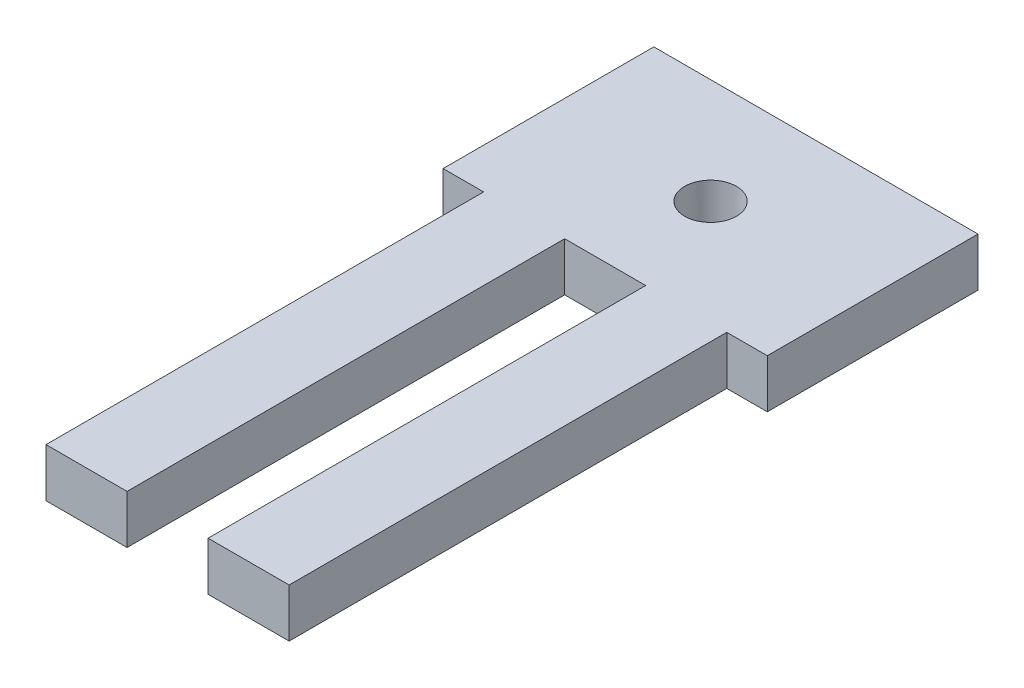
ISO-10303-21;
HEADER;
FILE_DESCRIPTION(('STEP AP214'),'2;1');
FILE_NAME('part.step','',(''),(''),'','','');
FILE_SCHEMA(('AUTOMOTIVE_DESIGN { 1 0 10303 214 1 1 1 1 }'));
ENDSEC;
DATA;
#1=APPLICATION_CONTEXT('core data for automotive mechanical design processes');
#2=APPLICATION_PROTOCOL_DEFINITION('international standard','automotive_design',2000,#1);
#3=PRODUCT_CONTEXT('',#1,'mechanical');
#4=PRODUCT('Part','Part','',(#3));
#5=PRODUCT_RELATED_PRODUCT_CATEGORY('part','',(#4));
#6=PRODUCT_DEFINITION_FORMATION('','',#4);
#7=PRODUCT_DEFINITION_CONTEXT('part definition',#1,'design');
#8=PRODUCT_DEFINITION('design','',#6,#7);
#9=PRODUCT_DEFINITION_SHAPE('','',#8);
#10=(LENGTH_UNIT() NAMED_UNIT(*) SI_UNIT(.MILLI.,.METRE.));
#11=(NAMED_UNIT(*) PLANE_ANGLE_UNIT() SI_UNIT($,.RADIAN.));
#12=(NAMED_UNIT(*) SI_UNIT($,.STERADIAN.) SOLID_ANGLE_UNIT());
#13=UNCERTAINTY_MEASURE_WITH_UNIT(LENGTH_MEASURE(1.E-05),#10,'distance_accuracy_value','');
#14=(GEOMETRIC_REPRESENTATION_CONTEXT(3) GLOBAL_UNCERTAINTY_ASSIGNED_CONTEXT((#13)) GLOBAL_UNIT_ASSIGNED_CONTEXT((#10,
#11,#12)) REPRESENTATION_CONTEXT('',''));
#15=CARTESIAN_POINT('',(0.,0.,0.));
#16=DIRECTION('',(0.,0.,1.));
#17=DIRECTION('',(1.,0.,0.));
#18=AXIS2_PLACEMENT_3D('',#15,#16,#17);
#19=CARTESIAN_POINT('',(0.,3.,0.));
#20=DIRECTION('',(0.,0.,-1.));
#21=DIRECTION('',(-1.,0.,0.));
#22=AXIS2_PLACEMENT_3D('',#19,#20,#21);
#23=PLANE('',#22);
#24=DIRECTION('',(1.,0.,0.));
#25=VECTOR('',#24,1.);
#26=CARTESIAN_POINT('',(0.,3.,0.));
#27=LINE('',#26,#25);
#28=CARTESIAN_POINT('',(12.5,3.,0.));
#29=VERTEX_POINT('',#28);
#30=CARTESIAN_POINT('',(17.5,3.,0.));
#31=VERTEX_POINT('',#30);
#32=EDGE_CURVE('E203',#29,#31,#27,.T.);
#33=ORIENTED_EDGE('',*,*,#32,.F.);
#34=DIRECTION('',(0.,1.,0.));
#35=VECTOR('',#34,1.);
#36=CARTESIAN_POINT('',(12.5,0.,0.));
#37=LINE('',#36,#35);
#38=CARTESIAN_POINT('',(12.5,0.,0.));
#39=VERTEX_POINT('',#38);
#40=EDGE_CURVE('E147',#39,#29,#37,.T.);
#41=ORIENTED_EDGE('',*,*,#40,.F.);
#42=DIRECTION('',(1.,0.,0.));
#43=VECTOR('',#42,1.);
#44=CARTESIAN_POINT('',(0.,0.,0.));
#45=LINE('',#44,#43);
#46=CARTESIAN_POINT('',(17.5,0.,0.));
#47=VERTEX_POINT('',#46);
#48=EDGE_CURVE('E143',#39,#47,#45,.T.);
#49=ORIENTED_EDGE('',*,*,#48,.T.);
#50=DIRECTION('',(0.,1.,0.));
#51=VECTOR('',#50,1.);
#52=CARTESIAN_POINT('',(17.5,-0.00100000000000013,0.));
#53=LINE('',#52,#51);
#54=EDGE_CURVE('E173',#47,#31,#53,.T.);
#55=ORIENTED_EDGE('',*,*,#54,.T.);
#56=EDGE_LOOP('',(#33,#41,#49,#55));
#57=FACE_BOUND('',#56,.T.);
#58=ADVANCED_FACE('F33',(#57),#23,.F.);
#59=CARTESIAN_POINT('',(2.5,0.,0.));
#60=VERTEX_POINT('',#59);
#61=CARTESIAN_POINT('',(7.5,0.,0.));
#62=VERTEX_POINT('',#61);
#63=EDGE_CURVE('E214',#60,#62,#45,.T.);
#64=ORIENTED_EDGE('',*,*,#63,.T.);
#65=DIRECTION('',(0.,1.,0.));
#66=VECTOR('',#65,1.);
#67=CARTESIAN_POINT('',(7.5,0.,0.));
#68=LINE('',#67,#66);
#69=CARTESIAN_POINT('',(7.5,3.,0.));
#70=VERTEX_POINT('',#69);
#71=EDGE_CURVE('E150',#62,#70,#68,.T.);
#72=ORIENTED_EDGE('',*,*,#71,.T.);
#73=CARTESIAN_POINT('',(2.5,3.,0.));
#74=VERTEX_POINT('',#73);
#75=EDGE_CURVE('E205',#74,#70,#27,.T.);
#76=ORIENTED_EDGE('',*,*,#75,.F.);
#77=DIRECTION('',(0.,1.,0.));
#78=VECTOR('',#77,1.);
#79=CARTESIAN_POINT('',(2.5,-0.00100000000000013,0.));
#80=LINE('',#79,#78);
#81=EDGE_CURVE('E192',#60,#74,#80,.T.);
#82=ORIENTED_EDGE('',*,*,#81,.F.);
#83=EDGE_LOOP('',(#64,#72,#76,#82));
#84=FACE_BOUND('',#83,.T.);
#85=ADVANCED_FACE('F253',(#84),#23,.F.);
#86=CARTESIAN_POINT('',(20.,3.,0.));
#87=DIRECTION('',(-1.,0.,0.));
#88=DIRECTION('',(0.,0.,1.));
#89=AXIS2_PLACEMENT_3D('',#86,#87,#88);
#90=PLANE('',#89);
#91=DIRECTION('',(0.,1.,0.));
#92=VECTOR('',#91,1.);
#93=CARTESIAN_POINT('',(20.,-0.00100000000000013,-27.));
#94=LINE('',#93,#92);
#95=CARTESIAN_POINT('',(20.,0.,-27.));
#96=VERTEX_POINT('',#95);
#97=CARTESIAN_POINT('',(20.,3.,-27.));
#98=VERTEX_POINT('',#97);
#99=EDGE_CURVE('E172',#96,#98,#94,.T.);
#100=ORIENTED_EDGE('',*,*,#99,.F.);
#101=DIRECTION('',(0.,0.,-1.));
#102=VECTOR('',#101,1.);
#103=CARTESIAN_POINT('',(20.,0.,0.));
#104=LINE('',#103,#102);
#105=CARTESIAN_POINT('',(20.,0.,-40.));
#106=VERTEX_POINT('',#105);
#107=EDGE_CURVE('E217',#96,#106,#104,.T.);
#108=ORIENTED_EDGE('',*,*,#107,.T.);
#109=DIRECTION('',(0.,-1.,0.));
#110=VECTOR('',#109,1.);
#111=CARTESIAN_POINT('',(20.,3.,-40.));
#112=LINE('',#111,#110);
#113=CARTESIAN_POINT('',(20.,3.,-40.));
#114=VERTEX_POINT('',#113);
#115=EDGE_CURVE('E11',#114,#106,#112,.T.);
#116=ORIENTED_EDGE('',*,*,#115,.F.);
#117=DIRECTION('',(0.,0.,-1.));
#118=VECTOR('',#117,1.);
#119=CARTESIAN_POINT('',(20.,3.,0.));
#120=LINE('',#119,#118);
#121=EDGE_CURVE('E208',#98,#114,#120,.T.);
#122=ORIENTED_EDGE('',*,*,#121,.F.);
#123=EDGE_LOOP('',(#100,#108,#116,#122));
#124=FACE_BOUND('',#123,.T.);
#125=ADVANCED_FACE('F241',(#124),#90,.F.);
#126=CARTESIAN_POINT('',(0.,3.,0.));
#127=DIRECTION('',(0.,-1.,0.));
#128=DIRECTION('',(0.,0.,-1.));
#129=AXIS2_PLACEMENT_3D('',#126,#127,#128);
#130=PLANE('',#129);
#131=CARTESIAN_POINT('',(10.,3.,-33.5));
#132=DIRECTION('',(0.,-1.,0.));
#133=DIRECTION('',(0.,0.,-1.));
#134=AXIS2_PLACEMENT_3D('',#131,#132,#133);
#135=CIRCLE('',#134,1.6);
#136=CARTESIAN_POINT('',(10.,3.,-35.1));
#137=VERTEX_POINT('',#136);
#138=EDGE_CURVE('E162',#137,#137,#135,.T.);
#139=ORIENTED_EDGE('',*,*,#138,.T.);
#140=EDGE_LOOP('',(#139));
#141=FACE_BOUND('',#140,.T.);
#142=DIRECTION('',(1.,0.,0.));
#143=VECTOR('',#142,1.);
#144=CARTESIAN_POINT('',(0.,3.,-27.));
#145=LINE('',#144,#143);
#146=CARTESIAN_POINT('',(7.5,3.,-27.));
#147=VERTEX_POINT('',#146);
#148=CARTESIAN_POINT('',(12.5,3.,-27.));
#149=VERTEX_POINT('',#148);
#150=EDGE_CURVE('E149',#147,#149,#145,.T.);
#151=ORIENTED_EDGE('',*,*,#150,.T.);
#152=DIRECTION('',(0.,0.,1.));
#153=VECTOR('',#152,1.);
#154=CARTESIAN_POINT('',(12.5,3.,0.));
#155=LINE('',#154,#153);
#156=EDGE_CURVE('E130',#149,#29,#155,.T.);
#157=ORIENTED_EDGE('',*,*,#156,.T.);
#158=ORIENTED_EDGE('',*,*,#32,.T.);
#159=DIRECTION('',(0.,0.,-1.));
#160=VECTOR('',#159,1.);
#161=CARTESIAN_POINT('',(17.5,3.,-27.));
#162=LINE('',#161,#160);
#163=CARTESIAN_POINT('',(17.5,3.,-27.));
#164=VERTEX_POINT('',#163);
#165=EDGE_CURVE('E169',#31,#164,#162,.T.);
#166=ORIENTED_EDGE('',*,*,#165,.T.);
#167=DIRECTION('',(1.,0.,0.));
#168=VECTOR('',#167,1.);
#169=CARTESIAN_POINT('',(20.,3.,-27.));
#170=LINE('',#169,#168);
#171=EDGE_CURVE('E166',#164,#98,#170,.T.);
#172=ORIENTED_EDGE('',*,*,#171,.T.);
#173=ORIENTED_EDGE('',*,*,#121,.T.);
#174=DIRECTION('',(-1.,0.,0.));
#175=VECTOR('',#174,1.);
#176=CARTESIAN_POINT('',(0.,3.,-40.));
#177=LINE('',#176,#175);
#178=CARTESIAN_POINT('',(0.,3.,-40.));
#179=VERTEX_POINT('',#178);
#180=EDGE_CURVE('E210',#114,#179,#177,.T.);
#181=ORIENTED_EDGE('',*,*,#180,.T.);
#182=DIRECTION('',(0.,0.,1.));
#183=VECTOR('',#182,1.);
#184=CARTESIAN_POINT('',(0.,3.,0.));
#185=LINE('',#184,#183);
#186=CARTESIAN_POINT('',(0.,3.,-27.));
#187=VERTEX_POINT('',#186);
#188=EDGE_CURVE('E200',#179,#187,#185,.T.);
#189=ORIENTED_EDGE('',*,*,#188,.T.);
#190=DIRECTION('',(-1.,0.,0.));
#191=VECTOR('',#190,1.);
#192=CARTESIAN_POINT('',(0.,3.,-27.));
#193=LINE('',#192,#191);
#194=CARTESIAN_POINT('',(2.5,3.,-27.));
#195=VERTEX_POINT('',#194);
#196=EDGE_CURVE('E190',#195,#187,#193,.T.);
#197=ORIENTED_EDGE('',*,*,#196,.F.);
#198=DIRECTION('',(0.,0.,-1.));
#199=VECTOR('',#198,1.);
#200=CARTESIAN_POINT('',(2.5,3.,-27.));
#201=LINE('',#200,#199);
#202=EDGE_CURVE('E187',#74,#195,#201,.T.);
#203=ORIENTED_EDGE('',*,*,#202,.F.);
#204=ORIENTED_EDGE('',*,*,#75,.T.);
#205=DIRECTION('',(0.,0.,-1.));
#206=VECTOR('',#205,1.);
#207=CARTESIAN_POINT('',(7.5,3.,0.));
#208=LINE('',#207,#206);
#209=EDGE_CURVE('E155',#70,#147,#208,.T.);
#210=ORIENTED_EDGE('',*,*,#209,.T.);
#211=EDGE_LOOP('',(#151,#157,#158,#166,#172,#173,#181,#189,#197,#203,#204,#210));
#212=FACE_BOUND('',#211,.T.);
#213=ADVANCED_FACE('F234',(#141,#212),#130,.F.);
#214=CARTESIAN_POINT('',(0.,0.,0.));
#215=DIRECTION('',(0.,-1.,0.));
#216=DIRECTION('',(0.,0.,-1.));
#217=AXIS2_PLACEMENT_3D('',#214,#215,#216);
#218=PLANE('',#217);
#219=DIRECTION('',(0.,0.,-1.));
#220=VECTOR('',#219,1.);
#221=CARTESIAN_POINT('',(12.5,0.,0.));
#222=LINE('',#221,#220);
#223=CARTESIAN_POINT('',(12.5,0.,-27.));
#224=VERTEX_POINT('',#223);
#225=EDGE_CURVE('E127',#39,#224,#222,.T.);
#226=ORIENTED_EDGE('',*,*,#225,.T.);
#227=DIRECTION('',(-1.,0.,0.));
#228=VECTOR('',#227,1.);
#229=CARTESIAN_POINT('',(12.5,0.,-27.));
#230=LINE('',#229,#228);
#231=CARTESIAN_POINT('',(7.5,0.,-27.));
#232=VERTEX_POINT('',#231);
#233=EDGE_CURVE('E136',#224,#232,#230,.T.);
#234=ORIENTED_EDGE('',*,*,#233,.T.);
#235=DIRECTION('',(0.,0.,1.));
#236=VECTOR('',#235,1.);
#237=CARTESIAN_POINT('',(7.5,0.,0.));
#238=LINE('',#237,#236);
#239=EDGE_CURVE('E48',#232,#62,#238,.T.);
#240=ORIENTED_EDGE('',*,*,#239,.T.);
#241=ORIENTED_EDGE('',*,*,#63,.F.);
#242=DIRECTION('',(0.,0.,-1.));
#243=VECTOR('',#242,1.);
#244=CARTESIAN_POINT('',(2.5,0.,-27.));
#245=LINE('',#244,#243);
#246=CARTESIAN_POINT('',(2.5,0.,-27.));
#247=VERTEX_POINT('',#246);
#248=EDGE_CURVE('E181',#60,#247,#245,.T.);
#249=ORIENTED_EDGE('',*,*,#248,.T.);
#250=DIRECTION('',(-1.,0.,0.));
#251=VECTOR('',#250,1.);
#252=CARTESIAN_POINT('',(0.,0.,-27.));
#253=LINE('',#252,#251);
#254=CARTESIAN_POINT('',(0.,0.,-27.));
#255=VERTEX_POINT('',#254);
#256=EDGE_CURVE('E184',#247,#255,#253,.T.);
#257=ORIENTED_EDGE('',*,*,#256,.T.);
#258=DIRECTION('',(0.,0.,1.));
#259=VECTOR('',#258,1.);
#260=CARTESIAN_POINT('',(0.,0.,0.));
#261=LINE('',#260,#259);
#262=CARTESIAN_POINT('',(0.,0.,-40.));
#263=VERTEX_POINT('',#262);
#264=EDGE_CURVE('E196',#263,#255,#261,.T.);
#265=ORIENTED_EDGE('',*,*,#264,.F.);
#266=DIRECTION('',(-1.,0.,0.));
#267=VECTOR('',#266,1.);
#268=CARTESIAN_POINT('',(0.,0.,-40.));
#269=LINE('',#268,#267);
#270=EDGE_CURVE('E204',#106,#263,#269,.T.);
#271=ORIENTED_EDGE('',*,*,#270,.F.);
#272=ORIENTED_EDGE('',*,*,#107,.F.);
#273=DIRECTION('',(1.,0.,0.));
#274=VECTOR('',#273,1.);
#275=CARTESIAN_POINT('',(20.,0.,-27.));
#276=LINE('',#275,#274);
#277=CARTESIAN_POINT('',(17.5,0.,-27.));
#278=VERTEX_POINT('',#277);
#279=EDGE_CURVE('E176',#278,#96,#276,.T.);
#280=ORIENTED_EDGE('',*,*,#279,.F.);
#281=DIRECTION('',(0.,0.,-1.));
#282=VECTOR('',#281,1.);
#283=CARTESIAN_POINT('',(17.5,0.,-27.));
#284=LINE('',#283,#282);
#285=EDGE_CURVE('E56',#47,#278,#284,.T.);
#286=ORIENTED_EDGE('',*,*,#285,.F.);
#287=ORIENTED_EDGE('',*,*,#48,.F.);
#288=EDGE_LOOP('',(#226,#234,#240,#241,#249,#257,#265,#271,#272,#280,#286,#287));
#289=FACE_BOUND('',#288,.T.);
#290=CARTESIAN_POINT('',(10.,0.,-33.5));
#291=DIRECTION('',(0.,1.,0.));
#292=DIRECTION('',(0.,0.,1.));
#293=AXIS2_PLACEMENT_3D('',#290,#291,#292);
#294=CIRCLE('',#293,1.6);
#295=CARTESIAN_POINT('',(10.,0.,-31.9));
#296=VERTEX_POINT('',#295);
#297=EDGE_CURVE('E159',#296,#296,#294,.T.);
#298=ORIENTED_EDGE('',*,*,#297,.T.);
#299=EDGE_LOOP('',(#298));
#300=FACE_BOUND('',#299,.T.);
#301=ADVANCED_FACE('F141',(#289,#300),#218,.T.);
#302=CARTESIAN_POINT('',(0.,3.,0.));
#303=DIRECTION('',(1.,0.,0.));
#304=DIRECTION('',(0.,0.,-1.));
#305=AXIS2_PLACEMENT_3D('',#302,#303,#304);
#306=PLANE('',#305);
#307=ORIENTED_EDGE('',*,*,#264,.T.);
#308=DIRECTION('',(0.,1.,0.));
#309=VECTOR('',#308,1.);
#310=CARTESIAN_POINT('',(0.,-0.00100000000000013,-27.));
#311=LINE('',#310,#309);
#312=EDGE_CURVE('E193',#255,#187,#311,.T.);
#313=ORIENTED_EDGE('',*,*,#312,.T.);
#314=ORIENTED_EDGE('',*,*,#188,.F.);
#315=DIRECTION('',(0.,-1.,0.));
#316=VECTOR('',#315,1.);
#317=CARTESIAN_POINT('',(0.,3.,-40.));
#318=LINE('',#317,#316);
#319=EDGE_CURVE('E41',#179,#263,#318,.T.);
#320=ORIENTED_EDGE('',*,*,#319,.T.);
#321=EDGE_LOOP('',(#307,#313,#314,#320));
#322=FACE_BOUND('',#321,.T.);
#323=ADVANCED_FACE('F35',(#322),#306,.F.);
#324=CARTESIAN_POINT('',(0.,3.,-40.));
#325=DIRECTION('',(0.,0.,1.));
#326=DIRECTION('',(1.,0.,0.));
#327=AXIS2_PLACEMENT_3D('',#324,#325,#326);
#328=PLANE('',#327);
#329=ORIENTED_EDGE('',*,*,#270,.T.);
#330=ORIENTED_EDGE('',*,*,#319,.F.);
#331=ORIENTED_EDGE('',*,*,#180,.F.);
#332=ORIENTED_EDGE('',*,*,#115,.T.);
#333=EDGE_LOOP('',(#329,#330,#331,#332));
#334=FACE_BOUND('',#333,.T.);
#335=ADVANCED_FACE('F238',(#334),#328,.F.);
#336=CARTESIAN_POINT('',(0.,-0.00100000000000013,-27.));
#337=DIRECTION('',(0.,0.,-1.));
#338=DIRECTION('',(-1.,0.,0.));
#339=AXIS2_PLACEMENT_3D('',#336,#337,#338);
#340=PLANE('',#339);
#341=DIRECTION('',(0.,1.,0.));
#342=VECTOR('',#341,1.);
#343=CARTESIAN_POINT('',(2.5,-0.00100000000000013,-27.));
#344=LINE('',#343,#342);
#345=EDGE_CURVE('E197',#247,#195,#344,.T.);
#346=ORIENTED_EDGE('',*,*,#345,.T.);
#347=ORIENTED_EDGE('',*,*,#196,.T.);
#348=ORIENTED_EDGE('',*,*,#312,.F.);
#349=ORIENTED_EDGE('',*,*,#256,.F.);
#350=EDGE_LOOP('',(#346,#347,#348,#349));
#351=FACE_BOUND('',#350,.T.);
#352=ADVANCED_FACE('F231',(#351),#340,.F.);
#353=CARTESIAN_POINT('',(2.5,-0.00100000000000013,-27.));
#354=DIRECTION('',(1.,0.,0.));
#355=DIRECTION('',(0.,0.,-1.));
#356=AXIS2_PLACEMENT_3D('',#353,#354,#355);
#357=PLANE('',#356);
#358=ORIENTED_EDGE('',*,*,#81,.T.);
#359=ORIENTED_EDGE('',*,*,#202,.T.);
#360=ORIENTED_EDGE('',*,*,#345,.F.);
#361=ORIENTED_EDGE('',*,*,#248,.F.);
#362=EDGE_LOOP('',(#358,#359,#360,#361));
#363=FACE_BOUND('',#362,.T.);
#364=ADVANCED_FACE('F256',(#363),#357,.F.);
#365=CARTESIAN_POINT('',(17.5,-0.00100000000000013,-27.));
#366=DIRECTION('',(1.,0.,0.));
#367=DIRECTION('',(0.,0.,-1.));
#368=AXIS2_PLACEMENT_3D('',#365,#366,#367);
#369=PLANE('',#368);
#370=ORIENTED_EDGE('',*,*,#285,.T.);
#371=DIRECTION('',(0.,1.,0.));
#372=VECTOR('',#371,1.);
#373=CARTESIAN_POINT('',(17.5,-0.00100000000000013,-27.));
#374=LINE('',#373,#372);
#375=EDGE_CURVE('E177',#278,#164,#374,.T.);
#376=ORIENTED_EDGE('',*,*,#375,.T.);
#377=ORIENTED_EDGE('',*,*,#165,.F.);
#378=ORIENTED_EDGE('',*,*,#54,.F.);
#379=EDGE_LOOP('',(#370,#376,#377,#378));
#380=FACE_BOUND('',#379,.T.);
#381=ADVANCED_FACE('F247',(#380),#369,.T.);
#382=CARTESIAN_POINT('',(20.,-0.00100000000000013,-27.));
#383=DIRECTION('',(0.,0.,1.));
#384=DIRECTION('',(1.,0.,0.));
#385=AXIS2_PLACEMENT_3D('',#382,#383,#384);
#386=PLANE('',#385);
#387=ORIENTED_EDGE('',*,*,#279,.T.);
#388=ORIENTED_EDGE('',*,*,#99,.T.);
#389=ORIENTED_EDGE('',*,*,#171,.F.);
#390=ORIENTED_EDGE('',*,*,#375,.F.);
#391=EDGE_LOOP('',(#387,#388,#389,#390));
#392=FACE_BOUND('',#391,.T.);
#393=ADVANCED_FACE('F244',(#392),#386,.T.);
#394=CARTESIAN_POINT('',(10.,0.,-33.5));
#395=DIRECTION('',(0.,1.,0.));
#396=DIRECTION('',(0.,0.,1.));
#397=AXIS2_PLACEMENT_3D('',#394,#395,#396);
#398=CYLINDRICAL_SURFACE('',#397,1.6);
#399=ORIENTED_EDGE('',*,*,#297,.F.);
#400=EDGE_LOOP('',(#399));
#401=FACE_BOUND('',#400,.T.);
#402=ORIENTED_EDGE('',*,*,#138,.F.);
#403=EDGE_LOOP('',(#402));
#404=FACE_BOUND('',#403,.T.);
#405=ADVANCED_FACE('F282',(#401,#404),#398,.F.);
#406=CARTESIAN_POINT('',(12.5,0.,0.));
#407=DIRECTION('',(1.,0.,0.));
#408=DIRECTION('',(0.,0.,-1.));
#409=AXIS2_PLACEMENT_3D('',#406,#407,#408);
#410=PLANE('',#409);
#411=DIRECTION('',(0.,1.,0.));
#412=VECTOR('',#411,1.);
#413=CARTESIAN_POINT('',(12.5,0.,-27.));
#414=LINE('',#413,#412);
#415=EDGE_CURVE('E123',#224,#149,#414,.T.);
#416=ORIENTED_EDGE('',*,*,#415,.F.);
#417=ORIENTED_EDGE('',*,*,#225,.F.);
#418=ORIENTED_EDGE('',*,*,#40,.T.);
#419=ORIENTED_EDGE('',*,*,#156,.F.);
#420=EDGE_LOOP('',(#416,#417,#418,#419));
#421=FACE_BOUND('',#420,.T.);
#422=ADVANCED_FACE('F125',(#421),#410,.F.);
#423=CARTESIAN_POINT('',(7.5,0.,0.));
#424=DIRECTION('',(-1.,0.,0.));
#425=DIRECTION('',(0.,0.,1.));
#426=AXIS2_PLACEMENT_3D('',#423,#424,#425);
#427=PLANE('',#426);
#428=ORIENTED_EDGE('',*,*,#71,.F.);
#429=ORIENTED_EDGE('',*,*,#239,.F.);
#430=DIRECTION('',(0.,1.,0.));
#431=VECTOR('',#430,1.);
#432=CARTESIAN_POINT('',(7.5,0.,-27.));
#433=LINE('',#432,#431);
#434=EDGE_CURVE('E133',#232,#147,#433,.T.);
#435=ORIENTED_EDGE('',*,*,#434,.T.);
#436=ORIENTED_EDGE('',*,*,#209,.F.);
#437=EDGE_LOOP('',(#428,#429,#435,#436));
#438=FACE_BOUND('',#437,.T.);
#439=ADVANCED_FACE('F250',(#438),#427,.F.);
#440=CARTESIAN_POINT('',(12.5,0.,-27.));
#441=DIRECTION('',(0.,0.,-1.));
#442=DIRECTION('',(-1.,0.,0.));
#443=AXIS2_PLACEMENT_3D('',#440,#441,#442);
#444=PLANE('',#443);
#445=ORIENTED_EDGE('',*,*,#434,.F.);
#446=ORIENTED_EDGE('',*,*,#233,.F.);
#447=ORIENTED_EDGE('',*,*,#415,.T.);
#448=ORIENTED_EDGE('',*,*,#150,.F.);
#449=EDGE_LOOP('',(#445,#446,#447,#448));
#450=FACE_BOUND('',#449,.T.);
#451=ADVANCED_FACE('F137',(#450),#444,.F.);
#452=CLOSED_SHELL('',(#58,#85,#125,#213,#301,#323,#335,#352,#364,#381,#393,#405,#422,#439,#451));
#453=MANIFOLD_SOLID_BREP('B2',#452);
#454=ADVANCED_BREP_SHAPE_REPRESENTATION('',(#18,#453),#14);
#455=SHAPE_DEFINITION_REPRESENTATION(#9,#454);
ENDSEC;
END-ISO-10303-21;
